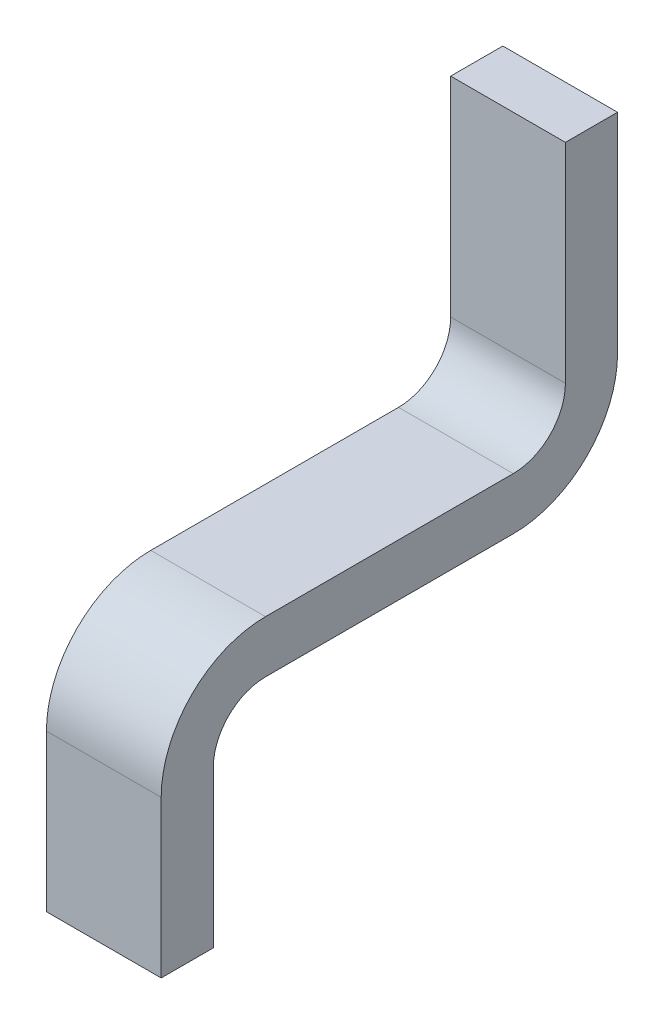
ISO-10303-21;
HEADER;
FILE_DESCRIPTION(('STEP AP214'),'2;1');
FILE_NAME('part.step','',(''),(''),'','','');
FILE_SCHEMA(('AUTOMOTIVE_DESIGN { 1 0 10303 214 1 1 1 1 }'));
ENDSEC;
DATA;
#1=APPLICATION_CONTEXT('core data for automotive mechanical design processes');
#2=APPLICATION_PROTOCOL_DEFINITION('international standard','automotive_design',2000,#1);
#3=PRODUCT_CONTEXT('',#1,'mechanical');
#4=PRODUCT('Part','Part','',(#3));
#5=PRODUCT_RELATED_PRODUCT_CATEGORY('part','',(#4));
#6=PRODUCT_DEFINITION_FORMATION('','',#4);
#7=PRODUCT_DEFINITION_CONTEXT('part definition',#1,'design');
#8=PRODUCT_DEFINITION('design','',#6,#7);
#9=PRODUCT_DEFINITION_SHAPE('','',#8);
#10=(LENGTH_UNIT() NAMED_UNIT(*) SI_UNIT(.MILLI.,.METRE.));
#11=(NAMED_UNIT(*) PLANE_ANGLE_UNIT() SI_UNIT($,.RADIAN.));
#12=(NAMED_UNIT(*) SI_UNIT($,.STERADIAN.) SOLID_ANGLE_UNIT());
#13=UNCERTAINTY_MEASURE_WITH_UNIT(LENGTH_MEASURE(1.E-05),#10,'distance_accuracy_value','');
#14=(GEOMETRIC_REPRESENTATION_CONTEXT(3) GLOBAL_UNCERTAINTY_ASSIGNED_CONTEXT((#13)) GLOBAL_UNIT_ASSIGNED_CONTEXT((#10,
#11,#12)) REPRESENTATION_CONTEXT('',''));
#15=CARTESIAN_POINT('',(0.,0.,0.));
#16=DIRECTION('',(0.,0.,1.));
#17=DIRECTION('',(1.,0.,0.));
#18=AXIS2_PLACEMENT_3D('',#15,#16,#17);
#19=CARTESIAN_POINT('',(2.86,4.,0.675));
#20=DIRECTION('',(-1.,0.,0.));
#21=DIRECTION('',(0.,-1.,0.));
#22=AXIS2_PLACEMENT_3D('',#19,#20,#21);
#23=PLANE('',#22);
#24=CARTESIAN_POINT('',(2.86,3.8,0.675));
#25=DIRECTION('',(1.,0.,0.));
#26=DIRECTION('',(0.,1.,0.));
#27=AXIS2_PLACEMENT_3D('',#24,#25,#26);
#28=CIRCLE('',#27,0.2);
#29=CARTESIAN_POINT('',(2.86,3.8,0.875));
#30=VERTEX_POINT('',#29);
#31=CARTESIAN_POINT('',(2.86,4.,0.675));
#32=VERTEX_POINT('',#31);
#33=EDGE_CURVE('E150',#30,#32,#28,.F.);
#34=ORIENTED_EDGE('',*,*,#33,.F.);
#35=DIRECTION('',(0.,1.,0.));
#36=VECTOR('',#35,1.);
#37=CARTESIAN_POINT('',(2.86,3.5,0.875));
#38=LINE('',#37,#36);
#39=CARTESIAN_POINT('',(2.86,3.5,0.875));
#40=VERTEX_POINT('',#39);
#41=EDGE_CURVE('E147',#30,#40,#38,.F.);
#42=ORIENTED_EDGE('',*,*,#41,.T.);
#43=DIRECTION('',(0.,0.,1.));
#44=VECTOR('',#43,1.);
#45=CARTESIAN_POINT('',(2.86,3.5,0.775));
#46=LINE('',#45,#44);
#47=CARTESIAN_POINT('',(2.86,3.5,0.775));
#48=VERTEX_POINT('',#47);
#49=EDGE_CURVE('E141',#48,#40,#46,.T.);
#50=ORIENTED_EDGE('',*,*,#49,.F.);
#51=DIRECTION('',(0.,1.,0.));
#52=VECTOR('',#51,1.);
#53=CARTESIAN_POINT('',(2.86,3.5,0.775));
#54=LINE('',#53,#52);
#55=CARTESIAN_POINT('',(2.86,3.8,0.775));
#56=VERTEX_POINT('',#55);
#57=EDGE_CURVE('E115',#48,#56,#54,.T.);
#58=ORIENTED_EDGE('',*,*,#57,.T.);
#59=CARTESIAN_POINT('',(2.86,3.8,0.675));
#60=DIRECTION('',(1.,0.,0.));
#61=DIRECTION('',(0.,1.,0.));
#62=AXIS2_PLACEMENT_3D('',#59,#60,#61);
#63=CIRCLE('',#62,0.1);
#64=CARTESIAN_POINT('',(2.86,3.9,0.675));
#65=VERTEX_POINT('',#64);
#66=EDGE_CURVE('E215',#56,#65,#63,.F.);
#67=ORIENTED_EDGE('',*,*,#66,.T.);
#68=DIRECTION('',(0.,0.,1.));
#69=VECTOR('',#68,1.);
#70=CARTESIAN_POINT('',(2.86,3.9,0.675));
#71=LINE('',#70,#69);
#72=CARTESIAN_POINT('',(2.86,3.9,0.2));
#73=VERTEX_POINT('',#72);
#74=EDGE_CURVE('E181',#65,#73,#71,.F.);
#75=ORIENTED_EDGE('',*,*,#74,.T.);
#76=CARTESIAN_POINT('',(2.86,4.1,0.2));
#77=DIRECTION('',(-1.,0.,0.));
#78=DIRECTION('',(0.,-1.,0.));
#79=AXIS2_PLACEMENT_3D('',#76,#77,#78);
#80=CIRCLE('',#79,0.2);
#81=CARTESIAN_POINT('',(2.86,4.1,0.));
#82=VERTEX_POINT('',#81);
#83=EDGE_CURVE('E20',#82,#73,#80,.T.);
#84=ORIENTED_EDGE('',*,*,#83,.F.);
#85=DIRECTION('',(0.,1.,0.));
#86=VECTOR('',#85,1.);
#87=CARTESIAN_POINT('',(2.86,4.1,0.));
#88=LINE('',#87,#86);
#89=CARTESIAN_POINT('',(2.86,4.5,0.));
#90=VERTEX_POINT('',#89);
#91=EDGE_CURVE('E91',#82,#90,#88,.T.);
#92=ORIENTED_EDGE('',*,*,#91,.T.);
#93=DIRECTION('',(0.,0.,1.));
#94=VECTOR('',#93,1.);
#95=CARTESIAN_POINT('',(2.86,4.5,0.));
#96=LINE('',#95,#94);
#97=CARTESIAN_POINT('',(2.86,4.5,0.1));
#98=VERTEX_POINT('',#97);
#99=EDGE_CURVE('E163',#90,#98,#96,.T.);
#100=ORIENTED_EDGE('',*,*,#99,.T.);
#101=DIRECTION('',(0.,1.,0.));
#102=VECTOR('',#101,1.);
#103=CARTESIAN_POINT('',(2.86,4.1,0.1));
#104=LINE('',#103,#102);
#105=CARTESIAN_POINT('',(2.86,4.1,0.1));
#106=VERTEX_POINT('',#105);
#107=EDGE_CURVE('E159',#98,#106,#104,.F.);
#108=ORIENTED_EDGE('',*,*,#107,.T.);
#109=CARTESIAN_POINT('',(2.86,4.1,0.2));
#110=DIRECTION('',(-1.,0.,0.));
#111=DIRECTION('',(0.,-1.,0.));
#112=AXIS2_PLACEMENT_3D('',#109,#110,#111);
#113=CIRCLE('',#112,0.1);
#114=CARTESIAN_POINT('',(2.86,4.,0.2));
#115=VERTEX_POINT('',#114);
#116=EDGE_CURVE('E155',#106,#115,#113,.T.);
#117=ORIENTED_EDGE('',*,*,#116,.T.);
#118=DIRECTION('',(0.,0.,1.));
#119=VECTOR('',#118,1.);
#120=CARTESIAN_POINT('',(2.86,4.,0.675));
#121=LINE('',#120,#119);
#122=EDGE_CURVE('E154',#115,#32,#121,.T.);
#123=ORIENTED_EDGE('',*,*,#122,.T.);
#124=EDGE_LOOP('',(#34,#42,#50,#58,#67,#75,#84,#92,#100,#108,#117,#123));
#125=FACE_BOUND('',#124,.T.);
#126=ADVANCED_FACE('F17',(#125),#23,.F.);
#127=CARTESIAN_POINT('',(2.86,4.1,0.2));
#128=DIRECTION('',(-1.,0.,0.));
#129=DIRECTION('',(0.,-1.,0.));
#130=AXIS2_PLACEMENT_3D('',#127,#128,#129);
#131=CYLINDRICAL_SURFACE('',#130,0.2);
#132=CARTESIAN_POINT('',(2.64,4.1,0.2));
#133=DIRECTION('',(-1.,0.,0.));
#134=DIRECTION('',(0.,-1.,0.));
#135=AXIS2_PLACEMENT_3D('',#132,#133,#134);
#136=CIRCLE('',#135,0.2);
#137=CARTESIAN_POINT('',(2.64,3.9,0.2));
#138=VERTEX_POINT('',#137);
#139=CARTESIAN_POINT('',(2.64,4.1,0.));
#140=VERTEX_POINT('',#139);
#141=EDGE_CURVE('E183',#138,#140,#136,.F.);
#142=ORIENTED_EDGE('',*,*,#141,.T.);
#143=DIRECTION('',(1.,0.,0.));
#144=VECTOR('',#143,1.);
#145=CARTESIAN_POINT('',(2.86,4.1,0.));
#146=LINE('',#145,#144);
#147=EDGE_CURVE('E178',#140,#82,#146,.T.);
#148=ORIENTED_EDGE('',*,*,#147,.T.);
#149=ORIENTED_EDGE('',*,*,#83,.T.);
#150=DIRECTION('',(-1.,0.,0.));
#151=VECTOR('',#150,1.);
#152=CARTESIAN_POINT('',(2.86,3.9,0.2));
#153=LINE('',#152,#151);
#154=EDGE_CURVE('E217',#73,#138,#153,.T.);
#155=ORIENTED_EDGE('',*,*,#154,.T.);
#156=EDGE_LOOP('',(#142,#148,#149,#155));
#157=FACE_BOUND('',#156,.T.);
#158=ADVANCED_FACE('F254',(#157),#131,.T.);
#159=CARTESIAN_POINT('',(2.86,4.1,0.));
#160=DIRECTION('',(0.,0.,1.));
#161=DIRECTION('',(1.,0.,0.));
#162=AXIS2_PLACEMENT_3D('',#159,#160,#161);
#163=PLANE('',#162);
#164=ORIENTED_EDGE('',*,*,#147,.F.);
#165=DIRECTION('',(0.,1.,0.));
#166=VECTOR('',#165,1.);
#167=CARTESIAN_POINT('',(2.64,3.9,0.));
#168=LINE('',#167,#166);
#169=CARTESIAN_POINT('',(2.64,4.5,0.));
#170=VERTEX_POINT('',#169);
#171=EDGE_CURVE('E170',#140,#170,#168,.T.);
#172=ORIENTED_EDGE('',*,*,#171,.T.);
#173=DIRECTION('',(1.,0.,0.));
#174=VECTOR('',#173,1.);
#175=CARTESIAN_POINT('',(2.86,4.5,0.));
#176=LINE('',#175,#174);
#177=EDGE_CURVE('E173',#170,#90,#176,.T.);
#178=ORIENTED_EDGE('',*,*,#177,.T.);
#179=ORIENTED_EDGE('',*,*,#91,.F.);
#180=EDGE_LOOP('',(#164,#172,#178,#179));
#181=FACE_BOUND('',#180,.T.);
#182=ADVANCED_FACE('F257',(#181),#163,.F.);
#183=CARTESIAN_POINT('',(2.86,4.5,0.));
#184=DIRECTION('',(0.,-1.,0.));
#185=DIRECTION('',(1.,0.,0.));
#186=AXIS2_PLACEMENT_3D('',#183,#184,#185);
#187=PLANE('',#186);
#188=DIRECTION('',(-1.,0.,0.));
#189=VECTOR('',#188,1.);
#190=CARTESIAN_POINT('',(2.64,4.5,0.1));
#191=LINE('',#190,#189);
#192=CARTESIAN_POINT('',(2.64,4.5,0.1));
#193=VERTEX_POINT('',#192);
#194=EDGE_CURVE('E160',#193,#98,#191,.F.);
#195=ORIENTED_EDGE('',*,*,#194,.T.);
#196=ORIENTED_EDGE('',*,*,#99,.F.);
#197=ORIENTED_EDGE('',*,*,#177,.F.);
#198=DIRECTION('',(0.,0.,1.));
#199=VECTOR('',#198,1.);
#200=CARTESIAN_POINT('',(2.64,4.5,0.675));
#201=LINE('',#200,#199);
#202=EDGE_CURVE('E166',#170,#193,#201,.T.);
#203=ORIENTED_EDGE('',*,*,#202,.T.);
#204=EDGE_LOOP('',(#195,#196,#197,#203));
#205=FACE_BOUND('',#204,.T.);
#206=ADVANCED_FACE('F259',(#205),#187,.F.);
#207=CARTESIAN_POINT('',(2.64,4.1,0.1));
#208=DIRECTION('',(0.,0.,-1.));
#209=DIRECTION('',(-1.,0.,0.));
#210=AXIS2_PLACEMENT_3D('',#207,#208,#209);
#211=PLANE('',#210);
#212=DIRECTION('',(-1.,0.,0.));
#213=VECTOR('',#212,1.);
#214=CARTESIAN_POINT('',(2.64,4.1,0.1));
#215=LINE('',#214,#213);
#216=CARTESIAN_POINT('',(2.64,4.1,0.1));
#217=VERTEX_POINT('',#216);
#218=EDGE_CURVE('E156',#217,#106,#215,.F.);
#219=ORIENTED_EDGE('',*,*,#218,.T.);
#220=ORIENTED_EDGE('',*,*,#107,.F.);
#221=ORIENTED_EDGE('',*,*,#194,.F.);
#222=DIRECTION('',(0.,1.,0.));
#223=VECTOR('',#222,1.);
#224=CARTESIAN_POINT('',(2.64,3.9,0.1));
#225=LINE('',#224,#223);
#226=EDGE_CURVE('E169',#193,#217,#225,.F.);
#227=ORIENTED_EDGE('',*,*,#226,.T.);
#228=EDGE_LOOP('',(#219,#220,#221,#227));
#229=FACE_BOUND('',#228,.T.);
#230=ADVANCED_FACE('F234',(#229),#211,.F.);
#231=CARTESIAN_POINT('',(2.64,4.1,0.2));
#232=DIRECTION('',(-1.,0.,0.));
#233=DIRECTION('',(0.,-1.,0.));
#234=AXIS2_PLACEMENT_3D('',#231,#232,#233);
#235=CYLINDRICAL_SURFACE('',#234,0.1);
#236=DIRECTION('',(1.,0.,0.));
#237=VECTOR('',#236,1.);
#238=CARTESIAN_POINT('',(2.64,4.,0.2));
#239=LINE('',#238,#237);
#240=CARTESIAN_POINT('',(2.64,4.,0.2));
#241=VERTEX_POINT('',#240);
#242=EDGE_CURVE('E151',#241,#115,#239,.T.);
#243=ORIENTED_EDGE('',*,*,#242,.T.);
#244=ORIENTED_EDGE('',*,*,#116,.F.);
#245=ORIENTED_EDGE('',*,*,#218,.F.);
#246=CARTESIAN_POINT('',(2.64,4.1,0.2));
#247=DIRECTION('',(-1.,0.,0.));
#248=DIRECTION('',(0.,-1.,0.));
#249=AXIS2_PLACEMENT_3D('',#246,#247,#248);
#250=CIRCLE('',#249,0.1);
#251=EDGE_CURVE('E210',#217,#241,#250,.T.);
#252=ORIENTED_EDGE('',*,*,#251,.T.);
#253=EDGE_LOOP('',(#243,#244,#245,#252));
#254=FACE_BOUND('',#253,.T.);
#255=ADVANCED_FACE('F227',(#254),#235,.F.);
#256=CARTESIAN_POINT('',(2.64,4.,0.675));
#257=DIRECTION('',(0.,-1.,0.));
#258=DIRECTION('',(1.,0.,0.));
#259=AXIS2_PLACEMENT_3D('',#256,#257,#258);
#260=PLANE('',#259);
#261=DIRECTION('',(1.,0.,0.));
#262=VECTOR('',#261,1.);
#263=CARTESIAN_POINT('',(2.64,4.,0.675));
#264=LINE('',#263,#262);
#265=CARTESIAN_POINT('',(2.64,4.,0.675));
#266=VERTEX_POINT('',#265);
#267=EDGE_CURVE('E148',#32,#266,#264,.F.);
#268=ORIENTED_EDGE('',*,*,#267,.F.);
#269=ORIENTED_EDGE('',*,*,#122,.F.);
#270=ORIENTED_EDGE('',*,*,#242,.F.);
#271=DIRECTION('',(0.,0.,1.));
#272=VECTOR('',#271,1.);
#273=CARTESIAN_POINT('',(2.64,4.,0.675));
#274=LINE('',#273,#272);
#275=EDGE_CURVE('E209',#241,#266,#274,.T.);
#276=ORIENTED_EDGE('',*,*,#275,.T.);
#277=EDGE_LOOP('',(#268,#269,#270,#276));
#278=FACE_BOUND('',#277,.T.);
#279=ADVANCED_FACE('F224',(#278),#260,.F.);
#280=CARTESIAN_POINT('',(2.64000000000001,3.80000000000001,0.675));
#281=DIRECTION('',(1.,0.,0.));
#282=DIRECTION('',(0.,1.,0.));
#283=AXIS2_PLACEMENT_3D('',#280,#281,#282);
#284=CYLINDRICAL_SURFACE('',#283,0.2);
#285=ORIENTED_EDGE('',*,*,#33,.T.);
#286=ORIENTED_EDGE('',*,*,#267,.T.);
#287=CARTESIAN_POINT('',(2.64000000000001,3.80000000000001,0.675));
#288=DIRECTION('',(1.,0.,0.));
#289=DIRECTION('',(0.,1.,0.));
#290=AXIS2_PLACEMENT_3D('',#287,#288,#289);
#291=CIRCLE('',#290,0.2);
#292=CARTESIAN_POINT('',(2.64000000000001,3.80000000000001,0.875));
#293=VERTEX_POINT('',#292);
#294=EDGE_CURVE('E133',#266,#293,#291,.T.);
#295=ORIENTED_EDGE('',*,*,#294,.T.);
#296=DIRECTION('',(-1.,0.,0.));
#297=VECTOR('',#296,1.);
#298=CARTESIAN_POINT('',(2.64000000000001,3.80000000000001,0.875));
#299=LINE('',#298,#297);
#300=EDGE_CURVE('E144',#293,#30,#299,.F.);
#301=ORIENTED_EDGE('',*,*,#300,.T.);
#302=EDGE_LOOP('',(#285,#286,#295,#301));
#303=FACE_BOUND('',#302,.T.);
#304=ADVANCED_FACE('F285',(#303),#284,.T.);
#305=CARTESIAN_POINT('',(2.64,3.5,0.875));
#306=DIRECTION('',(0.,0.,-1.));
#307=DIRECTION('',(-1.,0.,0.));
#308=AXIS2_PLACEMENT_3D('',#305,#306,#307);
#309=PLANE('',#308);
#310=DIRECTION('',(1.,0.,0.));
#311=VECTOR('',#310,1.);
#312=CARTESIAN_POINT('',(2.86,3.5,0.875));
#313=LINE('',#312,#311);
#314=CARTESIAN_POINT('',(2.64,3.5,0.875));
#315=VERTEX_POINT('',#314);
#316=EDGE_CURVE('E118',#40,#315,#313,.F.);
#317=ORIENTED_EDGE('',*,*,#316,.F.);
#318=ORIENTED_EDGE('',*,*,#41,.F.);
#319=ORIENTED_EDGE('',*,*,#300,.F.);
#320=DIRECTION('',(0.,1.,0.));
#321=VECTOR('',#320,1.);
#322=CARTESIAN_POINT('',(2.64,3.9,0.875));
#323=LINE('',#322,#321);
#324=EDGE_CURVE('E131',#293,#315,#323,.F.);
#325=ORIENTED_EDGE('',*,*,#324,.T.);
#326=EDGE_LOOP('',(#317,#318,#319,#325));
#327=FACE_BOUND('',#326,.T.);
#328=ADVANCED_FACE('F282',(#327),#309,.F.);
#329=CARTESIAN_POINT('',(2.86,3.5,0.775));
#330=DIRECTION('',(0.,-1.,0.));
#331=DIRECTION('',(1.,0.,0.));
#332=AXIS2_PLACEMENT_3D('',#329,#330,#331);
#333=PLANE('',#332);
#334=ORIENTED_EDGE('',*,*,#49,.T.);
#335=ORIENTED_EDGE('',*,*,#316,.T.);
#336=DIRECTION('',(0.,0.,1.));
#337=VECTOR('',#336,1.);
#338=CARTESIAN_POINT('',(2.64,3.5,0.675));
#339=LINE('',#338,#337);
#340=CARTESIAN_POINT('',(2.64,3.5,0.775));
#341=VERTEX_POINT('',#340);
#342=EDGE_CURVE('E125',#315,#341,#339,.F.);
#343=ORIENTED_EDGE('',*,*,#342,.T.);
#344=DIRECTION('',(1.,0.,0.));
#345=VECTOR('',#344,1.);
#346=CARTESIAN_POINT('',(2.86,3.5,0.775));
#347=LINE('',#346,#345);
#348=EDGE_CURVE('E110',#341,#48,#347,.T.);
#349=ORIENTED_EDGE('',*,*,#348,.T.);
#350=EDGE_LOOP('',(#334,#335,#343,#349));
#351=FACE_BOUND('',#350,.T.);
#352=ADVANCED_FACE('F129',(#351),#333,.T.);
#353=CARTESIAN_POINT('',(2.86,3.5,0.775));
#354=DIRECTION('',(0.,0.,1.));
#355=DIRECTION('',(1.,0.,0.));
#356=AXIS2_PLACEMENT_3D('',#353,#354,#355);
#357=PLANE('',#356);
#358=ORIENTED_EDGE('',*,*,#348,.F.);
#359=DIRECTION('',(0.,1.,0.));
#360=VECTOR('',#359,1.);
#361=CARTESIAN_POINT('',(2.64,3.9,0.775));
#362=LINE('',#361,#360);
#363=CARTESIAN_POINT('',(2.64000000000001,3.80000000000001,0.775));
#364=VERTEX_POINT('',#363);
#365=EDGE_CURVE('E114',#341,#364,#362,.T.);
#366=ORIENTED_EDGE('',*,*,#365,.T.);
#367=DIRECTION('',(1.,0.,0.));
#368=VECTOR('',#367,1.);
#369=CARTESIAN_POINT('',(2.86,3.8,0.775));
#370=LINE('',#369,#368);
#371=EDGE_CURVE('E185',#364,#56,#370,.T.);
#372=ORIENTED_EDGE('',*,*,#371,.T.);
#373=ORIENTED_EDGE('',*,*,#57,.F.);
#374=EDGE_LOOP('',(#358,#366,#372,#373));
#375=FACE_BOUND('',#374,.T.);
#376=ADVANCED_FACE('F112',(#375),#357,.F.);
#377=CARTESIAN_POINT('',(2.86,3.8,0.675));
#378=DIRECTION('',(1.,0.,0.));
#379=DIRECTION('',(0.,1.,0.));
#380=AXIS2_PLACEMENT_3D('',#377,#378,#379);
#381=CYLINDRICAL_SURFACE('',#380,0.1);
#382=ORIENTED_EDGE('',*,*,#371,.F.);
#383=CARTESIAN_POINT('',(2.64000000000001,3.80000000000001,0.675));
#384=DIRECTION('',(1.,0.,0.));
#385=DIRECTION('',(0.,1.,0.));
#386=AXIS2_PLACEMENT_3D('',#383,#384,#385);
#387=CIRCLE('',#386,0.1);
#388=CARTESIAN_POINT('',(2.64,3.9,0.675));
#389=VERTEX_POINT('',#388);
#390=EDGE_CURVE('E26',#364,#389,#387,.F.);
#391=ORIENTED_EDGE('',*,*,#390,.T.);
#392=DIRECTION('',(-1.,0.,0.));
#393=VECTOR('',#392,1.);
#394=CARTESIAN_POINT('',(2.86,3.9,0.675));
#395=LINE('',#394,#393);
#396=EDGE_CURVE('E34',#389,#65,#395,.F.);
#397=ORIENTED_EDGE('',*,*,#396,.T.);
#398=ORIENTED_EDGE('',*,*,#66,.F.);
#399=EDGE_LOOP('',(#382,#391,#397,#398));
#400=FACE_BOUND('',#399,.T.);
#401=ADVANCED_FACE('F250',(#400),#381,.F.);
#402=CARTESIAN_POINT('',(2.86,3.9,0.675));
#403=DIRECTION('',(0.,1.,0.));
#404=DIRECTION('',(-1.,0.,0.));
#405=AXIS2_PLACEMENT_3D('',#402,#403,#404);
#406=PLANE('',#405);
#407=ORIENTED_EDGE('',*,*,#396,.F.);
#408=DIRECTION('',(0.,0.,1.));
#409=VECTOR('',#408,1.);
#410=CARTESIAN_POINT('',(2.64,3.9,0.675));
#411=LINE('',#410,#409);
#412=EDGE_CURVE('E11',#389,#138,#411,.F.);
#413=ORIENTED_EDGE('',*,*,#412,.T.);
#414=ORIENTED_EDGE('',*,*,#154,.F.);
#415=ORIENTED_EDGE('',*,*,#74,.F.);
#416=EDGE_LOOP('',(#407,#413,#414,#415));
#417=FACE_BOUND('',#416,.T.);
#418=ADVANCED_FACE('F252',(#417),#406,.F.);
#419=CARTESIAN_POINT('',(2.64,3.9,0.675));
#420=DIRECTION('',(1.,0.,0.));
#421=DIRECTION('',(0.,1.,0.));
#422=AXIS2_PLACEMENT_3D('',#419,#420,#421);
#423=PLANE('',#422);
#424=ORIENTED_EDGE('',*,*,#390,.F.);
#425=ORIENTED_EDGE('',*,*,#365,.F.);
#426=ORIENTED_EDGE('',*,*,#342,.F.);
#427=ORIENTED_EDGE('',*,*,#324,.F.);
#428=ORIENTED_EDGE('',*,*,#294,.F.);
#429=ORIENTED_EDGE('',*,*,#275,.F.);
#430=ORIENTED_EDGE('',*,*,#251,.F.);
#431=ORIENTED_EDGE('',*,*,#226,.F.);
#432=ORIENTED_EDGE('',*,*,#202,.F.);
#433=ORIENTED_EDGE('',*,*,#171,.F.);
#434=ORIENTED_EDGE('',*,*,#141,.F.);
#435=ORIENTED_EDGE('',*,*,#412,.F.);
#436=EDGE_LOOP('',(#424,#425,#426,#427,#428,#429,#430,#431,#432,#433,#434,#435));
#437=FACE_BOUND('',#436,.T.);
#438=ADVANCED_FACE('F123',(#437),#423,.F.);
#439=CLOSED_SHELL('',(#126,#158,#182,#206,#230,#255,#279,#304,#328,#352,#376,#401,#418,#438));
#440=MANIFOLD_SOLID_BREP('B1',#439);
#441=ADVANCED_BREP_SHAPE_REPRESENTATION('',(#18,#440),#14);
#442=SHAPE_DEFINITION_REPRESENTATION(#9,#441);
ENDSEC;
END-ISO-10303-21;
